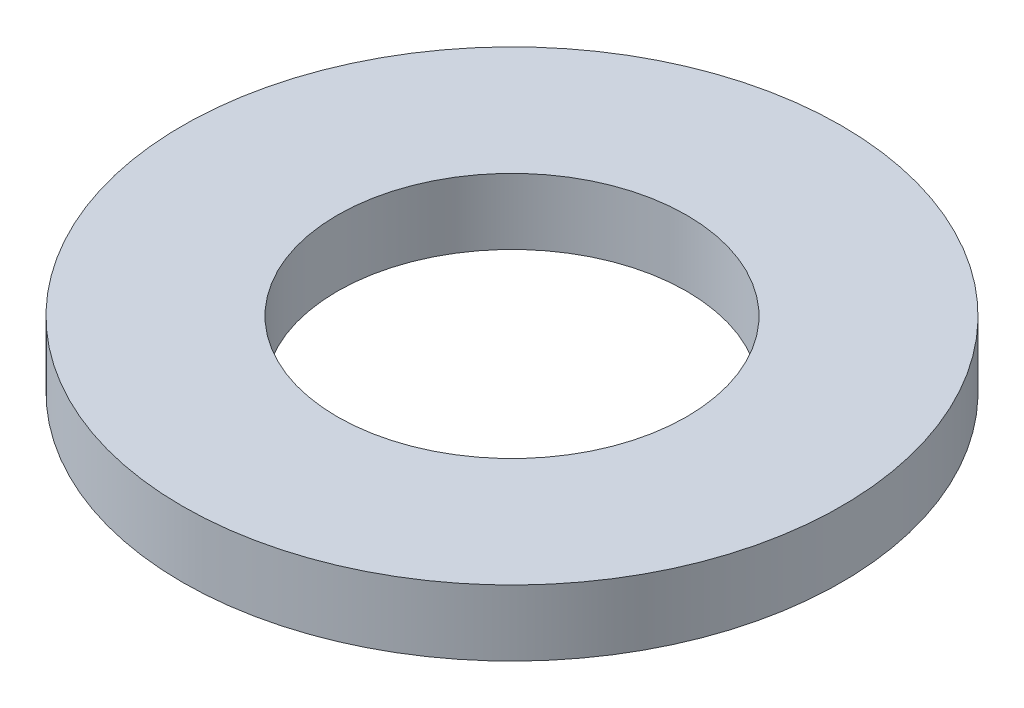
ISO-10303-21;
HEADER;
FILE_DESCRIPTION(('STEP AP214'),'2;1');
FILE_NAME('part.step','',(''),(''),'','','');
FILE_SCHEMA(('AUTOMOTIVE_DESIGN { 1 0 10303 214 1 1 1 1 }'));
ENDSEC;
DATA;
#1=APPLICATION_CONTEXT('core data for automotive mechanical design processes');
#2=APPLICATION_PROTOCOL_DEFINITION('international standard','automotive_design',2000,#1);
#3=PRODUCT_CONTEXT('',#1,'mechanical');
#4=PRODUCT('Part','Part','',(#3));
#5=PRODUCT_RELATED_PRODUCT_CATEGORY('part','',(#4));
#6=PRODUCT_DEFINITION_FORMATION('','',#4);
#7=PRODUCT_DEFINITION_CONTEXT('part definition',#1,'design');
#8=PRODUCT_DEFINITION('design','',#6,#7);
#9=PRODUCT_DEFINITION_SHAPE('','',#8);
#10=(LENGTH_UNIT() NAMED_UNIT(*) SI_UNIT(.MILLI.,.METRE.));
#11=(NAMED_UNIT(*) PLANE_ANGLE_UNIT() SI_UNIT($,.RADIAN.));
#12=(NAMED_UNIT(*) SI_UNIT($,.STERADIAN.) SOLID_ANGLE_UNIT());
#13=UNCERTAINTY_MEASURE_WITH_UNIT(LENGTH_MEASURE(1.E-05),#10,'distance_accuracy_value','');
#14=(GEOMETRIC_REPRESENTATION_CONTEXT(3) GLOBAL_UNCERTAINTY_ASSIGNED_CONTEXT((#13)) GLOBAL_UNIT_ASSIGNED_CONTEXT((#10,
#11,#12)) REPRESENTATION_CONTEXT('',''));
#15=CARTESIAN_POINT('',(0.,0.,0.));
#16=DIRECTION('',(0.,0.,1.));
#17=DIRECTION('',(1.,0.,0.));
#18=AXIS2_PLACEMENT_3D('',#15,#16,#17);
#19=CARTESIAN_POINT('',(0.,1.,0.));
#20=DIRECTION('',(0.,1.,0.));
#21=DIRECTION('',(0.,0.,1.));
#22=AXIS2_PLACEMENT_3D('',#19,#20,#21);
#23=PLANE('',#22);
#24=CARTESIAN_POINT('',(0.,1.,0.));
#25=DIRECTION('',(0.,1.,0.));
#26=DIRECTION('',(0.,0.,1.));
#27=AXIS2_PLACEMENT_3D('',#24,#25,#26);
#28=CIRCLE('',#27,5.);
#29=CARTESIAN_POINT('',(0.,1.,5.));
#30=VERTEX_POINT('',#29);
#31=EDGE_CURVE('E10',#30,#30,#28,.T.);
#32=ORIENTED_EDGE('',*,*,#31,.T.);
#33=EDGE_LOOP('',(#32));
#34=FACE_BOUND('',#33,.T.);
#35=CARTESIAN_POINT('',(0.,1.,0.));
#36=DIRECTION('',(0.,1.,0.));
#37=DIRECTION('',(0.,0.,1.));
#38=AXIS2_PLACEMENT_3D('',#35,#36,#37);
#39=CIRCLE('',#38,2.65);
#40=CARTESIAN_POINT('',(0.,1.,2.65));
#41=VERTEX_POINT('',#40);
#42=EDGE_CURVE('E43',#41,#41,#39,.T.);
#43=ORIENTED_EDGE('',*,*,#42,.F.);
#44=EDGE_LOOP('',(#43));
#45=FACE_BOUND('',#44,.T.);
#46=ADVANCED_FACE('F32',(#34,#45),#23,.T.);
#47=CARTESIAN_POINT('',(0.,0.,0.));
#48=DIRECTION('',(0.,1.,0.));
#49=DIRECTION('',(0.,0.,1.));
#50=AXIS2_PLACEMENT_3D('',#47,#48,#49);
#51=PLANE('',#50);
#52=CARTESIAN_POINT('',(0.,0.,0.));
#53=DIRECTION('',(0.,1.,0.));
#54=DIRECTION('',(0.,0.,1.));
#55=AXIS2_PLACEMENT_3D('',#52,#53,#54);
#56=CIRCLE('',#55,5.);
#57=CARTESIAN_POINT('',(0.,0.,5.));
#58=VERTEX_POINT('',#57);
#59=EDGE_CURVE('E36',#58,#58,#56,.T.);
#60=ORIENTED_EDGE('',*,*,#59,.F.);
#61=EDGE_LOOP('',(#60));
#62=FACE_BOUND('',#61,.T.);
#63=CARTESIAN_POINT('',(0.,0.,0.));
#64=DIRECTION('',(0.,1.,0.));
#65=DIRECTION('',(0.,0.,1.));
#66=AXIS2_PLACEMENT_3D('',#63,#64,#65);
#67=CIRCLE('',#66,2.65);
#68=CARTESIAN_POINT('',(0.,0.,2.65));
#69=VERTEX_POINT('',#68);
#70=EDGE_CURVE('E45',#69,#69,#67,.T.);
#71=ORIENTED_EDGE('',*,*,#70,.T.);
#72=EDGE_LOOP('',(#71));
#73=FACE_BOUND('',#72,.T.);
#74=ADVANCED_FACE('F55',(#62,#73),#51,.F.);
#75=CARTESIAN_POINT('',(0.,1.,0.));
#76=DIRECTION('',(0.,-1.,0.));
#77=DIRECTION('',(0.,0.,-1.));
#78=AXIS2_PLACEMENT_3D('',#75,#76,#77);
#79=CYLINDRICAL_SURFACE('',#78,5.);
#80=ORIENTED_EDGE('',*,*,#31,.F.);
#81=EDGE_LOOP('',(#80));
#82=FACE_BOUND('',#81,.T.);
#83=ORIENTED_EDGE('',*,*,#59,.T.);
#84=EDGE_LOOP('',(#83));
#85=FACE_BOUND('',#84,.T.);
#86=ADVANCED_FACE('F34',(#82,#85),#79,.T.);
#87=CARTESIAN_POINT('',(0.,1.,0.));
#88=DIRECTION('',(0.,-1.,0.));
#89=DIRECTION('',(0.,0.,-1.));
#90=AXIS2_PLACEMENT_3D('',#87,#88,#89);
#91=CYLINDRICAL_SURFACE('',#90,2.65);
#92=ORIENTED_EDGE('',*,*,#42,.T.);
#93=EDGE_LOOP('',(#92));
#94=FACE_BOUND('',#93,.T.);
#95=ORIENTED_EDGE('',*,*,#70,.F.);
#96=EDGE_LOOP('',(#95));
#97=FACE_BOUND('',#96,.T.);
#98=ADVANCED_FACE('F51',(#94,#97),#91,.F.);
#99=CLOSED_SHELL('',(#46,#74,#86,#98));
#100=MANIFOLD_SOLID_BREP('B2',#99);
#101=ADVANCED_BREP_SHAPE_REPRESENTATION('',(#18,#100),#14);
#102=SHAPE_DEFINITION_REPRESENTATION(#9,#101);
ENDSEC;
END-ISO-10303-21;
